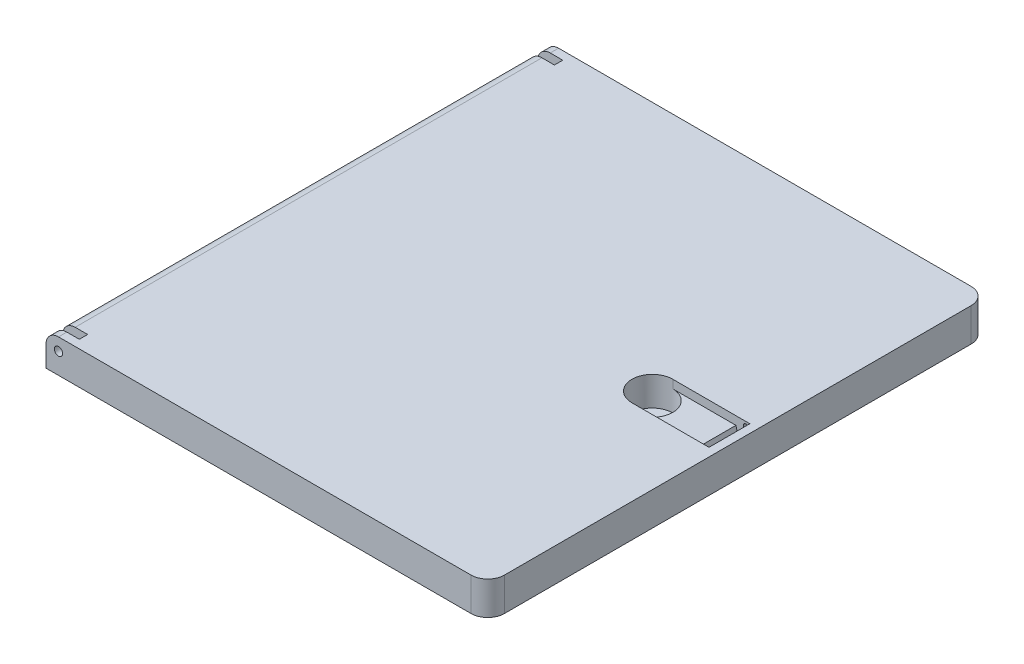
ISO-10303-21;
HEADER;
FILE_DESCRIPTION(('STEP AP214'),'2;1');
FILE_NAME('part.step','',(''),(''),'','','');
FILE_SCHEMA(('AUTOMOTIVE_DESIGN { 1 0 10303 214 1 1 1 1 }'));
ENDSEC;
DATA;
#1=APPLICATION_CONTEXT('core data for automotive mechanical design processes');
#2=APPLICATION_PROTOCOL_DEFINITION('international standard','automotive_design',2000,#1);
#3=PRODUCT_CONTEXT('',#1,'mechanical');
#4=PRODUCT('Part','Part','',(#3));
#5=PRODUCT_RELATED_PRODUCT_CATEGORY('part','',(#4));
#6=PRODUCT_DEFINITION_FORMATION('','',#4);
#7=PRODUCT_DEFINITION_CONTEXT('part definition',#1,'design');
#8=PRODUCT_DEFINITION('design','',#6,#7);
#9=PRODUCT_DEFINITION_SHAPE('','',#8);
#10=(LENGTH_UNIT() NAMED_UNIT(*) SI_UNIT(.MILLI.,.METRE.));
#11=(NAMED_UNIT(*) PLANE_ANGLE_UNIT() SI_UNIT($,.RADIAN.));
#12=(NAMED_UNIT(*) SI_UNIT($,.STERADIAN.) SOLID_ANGLE_UNIT());
#13=UNCERTAINTY_MEASURE_WITH_UNIT(LENGTH_MEASURE(1.E-05),#10,'distance_accuracy_value','');
#14=(GEOMETRIC_REPRESENTATION_CONTEXT(3) GLOBAL_UNCERTAINTY_ASSIGNED_CONTEXT((#13)) GLOBAL_UNIT_ASSIGNED_CONTEXT((#10,
#11,#12)) REPRESENTATION_CONTEXT('',''));
#15=CARTESIAN_POINT('',(0.,0.,0.));
#16=DIRECTION('',(0.,0.,1.));
#17=DIRECTION('',(1.,0.,0.));
#18=AXIS2_PLACEMENT_3D('',#15,#16,#17);
#19=CARTESIAN_POINT('',(-106.,-8.,0.));
#20=DIRECTION('',(-1.,0.,0.));
#21=DIRECTION('',(0.,0.,1.));
#22=AXIS2_PLACEMENT_3D('',#19,#20,#21);
#23=PLANE('',#22);
#24=DIRECTION('',(0.,1.,0.));
#25=VECTOR('',#24,1.);
#26=CARTESIAN_POINT('',(-106.,-8.,60.));
#27=LINE('',#26,#25);
#28=CARTESIAN_POINT('',(-106.,-8.,60.));
#29=VERTEX_POINT('',#28);
#30=CARTESIAN_POINT('',(-106.,-3.,60.));
#31=VERTEX_POINT('',#30);
#32=EDGE_CURVE('E266',#29,#31,#27,.T.);
#33=ORIENTED_EDGE('',*,*,#32,.T.);
#34=DIRECTION('',(0.,0.,1.));
#35=VECTOR('',#34,1.);
#36=CARTESIAN_POINT('',(-106.,-3.,-60.));
#37=LINE('',#36,#35);
#38=CARTESIAN_POINT('',(-106.,-3.,58.));
#39=VERTEX_POINT('',#38);
#40=EDGE_CURVE('E240',#39,#31,#37,.T.);
#41=ORIENTED_EDGE('',*,*,#40,.F.);
#42=DIRECTION('',(0.,1.,0.));
#43=VECTOR('',#42,1.);
#44=CARTESIAN_POINT('',(-106.,-6.,58.));
#45=LINE('',#44,#43);
#46=CARTESIAN_POINT('',(-106.,-6.,58.));
#47=VERTEX_POINT('',#46);
#48=EDGE_CURVE('E330',#47,#39,#45,.T.);
#49=ORIENTED_EDGE('',*,*,#48,.F.);
#50=DIRECTION('',(0.,0.,1.));
#51=VECTOR('',#50,1.);
#52=CARTESIAN_POINT('',(-106.,-6.,58.));
#53=LINE('',#52,#51);
#54=CARTESIAN_POINT('',(-106.,-6.,56.));
#55=VERTEX_POINT('',#54);
#56=EDGE_CURVE('E317',#55,#47,#53,.T.);
#57=ORIENTED_EDGE('',*,*,#56,.F.);
#58=DIRECTION('',(0.,1.,0.));
#59=VECTOR('',#58,1.);
#60=CARTESIAN_POINT('',(-106.,-6.,56.));
#61=LINE('',#60,#59);
#62=CARTESIAN_POINT('',(-106.,-3.,56.));
#63=VERTEX_POINT('',#62);
#64=EDGE_CURVE('E337',#55,#63,#61,.T.);
#65=ORIENTED_EDGE('',*,*,#64,.T.);
#66=CARTESIAN_POINT('',(-106.,-3.,-56.));
#67=VERTEX_POINT('',#66);
#68=EDGE_CURVE('E489',#67,#63,#37,.T.);
#69=ORIENTED_EDGE('',*,*,#68,.F.);
#70=DIRECTION('',(0.,1.,0.));
#71=VECTOR('',#70,1.);
#72=CARTESIAN_POINT('',(-106.,-6.,-56.));
#73=LINE('',#72,#71);
#74=CARTESIAN_POINT('',(-106.,-6.,-56.));
#75=VERTEX_POINT('',#74);
#76=EDGE_CURVE('E529',#75,#67,#73,.T.);
#77=ORIENTED_EDGE('',*,*,#76,.F.);
#78=DIRECTION('',(0.,0.,-1.));
#79=VECTOR('',#78,1.);
#80=CARTESIAN_POINT('',(-106.,-6.,-58.));
#81=LINE('',#80,#79);
#82=CARTESIAN_POINT('',(-106.,-6.,-58.));
#83=VERTEX_POINT('',#82);
#84=EDGE_CURVE('E521',#75,#83,#81,.T.);
#85=ORIENTED_EDGE('',*,*,#84,.T.);
#86=DIRECTION('',(0.,1.,0.));
#87=VECTOR('',#86,1.);
#88=CARTESIAN_POINT('',(-106.,-6.,-58.));
#89=LINE('',#88,#87);
#90=CARTESIAN_POINT('',(-106.,-3.,-58.));
#91=VERTEX_POINT('',#90);
#92=EDGE_CURVE('E301',#83,#91,#89,.T.);
#93=ORIENTED_EDGE('',*,*,#92,.T.);
#94=CARTESIAN_POINT('',(-106.,-3.,-60.));
#95=VERTEX_POINT('',#94);
#96=EDGE_CURVE('E55',#95,#91,#37,.T.);
#97=ORIENTED_EDGE('',*,*,#96,.F.);
#98=DIRECTION('',(0.,1.,0.));
#99=VECTOR('',#98,1.);
#100=CARTESIAN_POINT('',(-106.,-8.,-60.));
#101=LINE('',#100,#99);
#102=CARTESIAN_POINT('',(-106.,-8.,-60.));
#103=VERTEX_POINT('',#102);
#104=EDGE_CURVE('E251',#103,#95,#101,.T.);
#105=ORIENTED_EDGE('',*,*,#104,.F.);
#106=DIRECTION('',(0.,0.,1.));
#107=VECTOR('',#106,1.);
#108=CARTESIAN_POINT('',(-106.,-8.,0.));
#109=LINE('',#108,#107);
#110=EDGE_CURVE('E457',#103,#29,#109,.T.);
#111=ORIENTED_EDGE('',*,*,#110,.T.);
#112=EDGE_LOOP('',(#33,#41,#49,#57,#65,#69,#77,#85,#93,#97,#105,#111));
#113=FACE_BOUND('',#112,.T.);
#114=ADVANCED_FACE('F32',(#113),#23,.T.);
#115=CARTESIAN_POINT('',(0.,0.,0.));
#116=DIRECTION('',(0.,-1.,0.));
#117=DIRECTION('',(0.,0.,-1.));
#118=AXIS2_PLACEMENT_3D('',#115,#116,#117);
#119=PLANE('',#118);
#120=DIRECTION('',(0.,0.,-1.));
#121=VECTOR('',#120,1.);
#122=CARTESIAN_POINT('',(-2.,0.,0.));
#123=LINE('',#122,#121);
#124=CARTESIAN_POINT('',(-2.,0.,4.9));
#125=VERTEX_POINT('',#124);
#126=CARTESIAN_POINT('',(-2.,0.,-4.9));
#127=VERTEX_POINT('',#126);
#128=EDGE_CURVE('E427',#125,#127,#123,.T.);
#129=ORIENTED_EDGE('',*,*,#128,.F.);
#130=DIRECTION('',(1.,0.,0.));
#131=VECTOR('',#130,1.);
#132=CARTESIAN_POINT('',(-2.,0.,4.9));
#133=LINE('',#132,#131);
#134=CARTESIAN_POINT('',(-20.5,0.,4.9));
#135=VERTEX_POINT('',#134);
#136=EDGE_CURVE('E433',#135,#125,#133,.T.);
#137=ORIENTED_EDGE('',*,*,#136,.F.);
#138=CARTESIAN_POINT('',(-20.5,0.,0.));
#139=DIRECTION('',(0.,1.,0.));
#140=DIRECTION('',(0.,0.,1.));
#141=AXIS2_PLACEMENT_3D('',#138,#139,#140);
#142=CIRCLE('',#141,4.9);
#143=CARTESIAN_POINT('',(-20.5,0.,-4.9));
#144=VERTEX_POINT('',#143);
#145=EDGE_CURVE('E442',#144,#135,#142,.T.);
#146=ORIENTED_EDGE('',*,*,#145,.F.);
#147=DIRECTION('',(-1.,0.,0.));
#148=VECTOR('',#147,1.);
#149=CARTESIAN_POINT('',(-2.,0.,-4.9));
#150=LINE('',#149,#148);
#151=EDGE_CURVE('E439',#127,#144,#150,.T.);
#152=ORIENTED_EDGE('',*,*,#151,.F.);
#153=EDGE_LOOP('',(#129,#137,#146,#152));
#154=FACE_BOUND('',#153,.T.);
#155=DIRECTION('',(0.,0.,1.));
#156=VECTOR('',#155,1.);
#157=CARTESIAN_POINT('',(-103.,0.,-60.));
#158=LINE('',#157,#156);
#159=CARTESIAN_POINT('',(-103.,0.,58.));
#160=VERTEX_POINT('',#159);
#161=CARTESIAN_POINT('',(-103.,0.,60.));
#162=VERTEX_POINT('',#161);
#163=EDGE_CURVE('E47',#160,#162,#158,.T.);
#164=ORIENTED_EDGE('',*,*,#163,.T.);
#165=DIRECTION('',(1.,0.,0.));
#166=VECTOR('',#165,1.);
#167=CARTESIAN_POINT('',(0.,0.,60.));
#168=LINE('',#167,#166);
#169=CARTESIAN_POINT('',(-4.,0.,60.));
#170=VERTEX_POINT('',#169);
#171=EDGE_CURVE('E257',#162,#170,#168,.T.);
#172=ORIENTED_EDGE('',*,*,#171,.T.);
#173=CARTESIAN_POINT('',(-4.,0.,56.));
#174=DIRECTION('',(0.,-1.,0.));
#175=DIRECTION('',(0.,0.,-1.));
#176=AXIS2_PLACEMENT_3D('',#173,#174,#175);
#177=CIRCLE('',#176,4.);
#178=CARTESIAN_POINT('',(0.,0.,56.));
#179=VERTEX_POINT('',#178);
#180=EDGE_CURVE('E275',#170,#179,#177,.F.);
#181=ORIENTED_EDGE('',*,*,#180,.T.);
#182=DIRECTION('',(0.,0.,-1.));
#183=VECTOR('',#182,1.);
#184=CARTESIAN_POINT('',(0.,0.,0.));
#185=LINE('',#184,#183);
#186=CARTESIAN_POINT('',(0.,0.,-56.));
#187=VERTEX_POINT('',#186);
#188=EDGE_CURVE('E258',#179,#187,#185,.T.);
#189=ORIENTED_EDGE('',*,*,#188,.T.);
#190=CARTESIAN_POINT('',(-4.,0.,-56.));
#191=DIRECTION('',(0.,-1.,0.));
#192=DIRECTION('',(0.,0.,-1.));
#193=AXIS2_PLACEMENT_3D('',#190,#191,#192);
#194=CIRCLE('',#193,4.);
#195=CARTESIAN_POINT('',(-4.,0.,-60.));
#196=VERTEX_POINT('',#195);
#197=EDGE_CURVE('E256',#187,#196,#194,.F.);
#198=ORIENTED_EDGE('',*,*,#197,.T.);
#199=DIRECTION('',(-1.,0.,0.));
#200=VECTOR('',#199,1.);
#201=CARTESIAN_POINT('',(0.,0.,-60.));
#202=LINE('',#201,#200);
#203=CARTESIAN_POINT('',(-103.,0.,-60.));
#204=VERTEX_POINT('',#203);
#205=EDGE_CURVE('E248',#196,#204,#202,.T.);
#206=ORIENTED_EDGE('',*,*,#205,.T.);
#207=CARTESIAN_POINT('',(-103.,0.,-58.));
#208=VERTEX_POINT('',#207);
#209=EDGE_CURVE('E232',#204,#208,#158,.T.);
#210=ORIENTED_EDGE('',*,*,#209,.T.);
#211=DIRECTION('',(1.,0.,0.));
#212=VECTOR('',#211,1.);
#213=CARTESIAN_POINT('',(-106.,0.,-58.));
#214=LINE('',#213,#212);
#215=CARTESIAN_POINT('',(-100.,0.,-58.));
#216=VERTEX_POINT('',#215);
#217=EDGE_CURVE('E524',#208,#216,#214,.T.);
#218=ORIENTED_EDGE('',*,*,#217,.T.);
#219=DIRECTION('',(0.,0.,1.));
#220=VECTOR('',#219,1.);
#221=CARTESIAN_POINT('',(-100.,0.,-58.));
#222=LINE('',#221,#220);
#223=CARTESIAN_POINT('',(-100.,0.,-56.));
#224=VERTEX_POINT('',#223);
#225=EDGE_CURVE('E517',#216,#224,#222,.T.);
#226=ORIENTED_EDGE('',*,*,#225,.T.);
#227=DIRECTION('',(-1.,0.,0.));
#228=VECTOR('',#227,1.);
#229=CARTESIAN_POINT('',(-106.,0.,-56.));
#230=LINE('',#229,#228);
#231=CARTESIAN_POINT('',(-103.,0.,-56.));
#232=VERTEX_POINT('',#231);
#233=EDGE_CURVE('E514',#224,#232,#230,.T.);
#234=ORIENTED_EDGE('',*,*,#233,.T.);
#235=CARTESIAN_POINT('',(-103.,0.,56.));
#236=VERTEX_POINT('',#235);
#237=EDGE_CURVE('E241',#232,#236,#158,.T.);
#238=ORIENTED_EDGE('',*,*,#237,.T.);
#239=DIRECTION('',(-1.,0.,0.));
#240=VECTOR('',#239,1.);
#241=CARTESIAN_POINT('',(-106.,0.,56.));
#242=LINE('',#241,#240);
#243=CARTESIAN_POINT('',(-100.,0.,56.));
#244=VERTEX_POINT('',#243);
#245=EDGE_CURVE('E321',#244,#236,#242,.T.);
#246=ORIENTED_EDGE('',*,*,#245,.F.);
#247=DIRECTION('',(0.,0.,-1.));
#248=VECTOR('',#247,1.);
#249=CARTESIAN_POINT('',(-100.,0.,58.));
#250=LINE('',#249,#248);
#251=CARTESIAN_POINT('',(-100.,0.,58.));
#252=VERTEX_POINT('',#251);
#253=EDGE_CURVE('E332',#252,#244,#250,.T.);
#254=ORIENTED_EDGE('',*,*,#253,.F.);
#255=DIRECTION('',(1.,0.,0.));
#256=VECTOR('',#255,1.);
#257=CARTESIAN_POINT('',(-106.,0.,58.));
#258=LINE('',#257,#256);
#259=EDGE_CURVE('E316',#160,#252,#258,.T.);
#260=ORIENTED_EDGE('',*,*,#259,.F.);
#261=EDGE_LOOP('',(#164,#172,#181,#189,#198,#206,#210,#218,#226,#234,#238,#246,#254,#260));
#262=FACE_BOUND('',#261,.T.);
#263=ADVANCED_FACE('F254',(#154,#262),#119,.F.);
#264=CARTESIAN_POINT('',(-103.,-3.,-60.));
#265=DIRECTION('',(0.,0.,1.));
#266=DIRECTION('',(1.,0.,0.));
#267=AXIS2_PLACEMENT_3D('',#264,#265,#266);
#268=CYLINDRICAL_SURFACE('',#267,0.999999999999998);
#269=CARTESIAN_POINT('',(-103.,-3.,-60.));
#270=DIRECTION('',(0.,0.,1.));
#271=DIRECTION('',(1.,0.,0.));
#272=AXIS2_PLACEMENT_3D('',#269,#270,#271);
#273=CIRCLE('',#272,0.999999999999998);
#274=CARTESIAN_POINT('',(-102.,-3.,-60.));
#275=VERTEX_POINT('',#274);
#276=EDGE_CURVE('E297',#275,#275,#273,.T.);
#277=ORIENTED_EDGE('',*,*,#276,.F.);
#278=EDGE_LOOP('',(#277));
#279=FACE_BOUND('',#278,.T.);
#280=CARTESIAN_POINT('',(-103.,-3.,-58.));
#281=DIRECTION('',(0.,0.,1.));
#282=DIRECTION('',(1.,0.,0.));
#283=AXIS2_PLACEMENT_3D('',#280,#281,#282);
#284=CIRCLE('',#283,0.999999999999998);
#285=CARTESIAN_POINT('',(-102.,-3.,-58.));
#286=VERTEX_POINT('',#285);
#287=EDGE_CURVE('E300',#286,#286,#284,.F.);
#288=ORIENTED_EDGE('',*,*,#287,.F.);
#289=EDGE_LOOP('',(#288));
#290=FACE_BOUND('',#289,.T.);
#291=ADVANCED_FACE('F571',(#279,#290),#268,.F.);
#292=CARTESIAN_POINT('',(-103.,-3.,56.));
#293=DIRECTION('',(0.,0.,-1.));
#294=DIRECTION('',(-1.,0.,0.));
#295=AXIS2_PLACEMENT_3D('',#292,#293,#294);
#296=CIRCLE('',#295,0.999999999999998);
#297=CARTESIAN_POINT('',(-104.,-3.,56.));
#298=VERTEX_POINT('',#297);
#299=EDGE_CURVE('E296',#298,#298,#296,.T.);
#300=ORIENTED_EDGE('',*,*,#299,.F.);
#301=EDGE_LOOP('',(#300));
#302=FACE_BOUND('',#301,.T.);
#303=CARTESIAN_POINT('',(-103.,-3.,-56.));
#304=DIRECTION('',(0.,0.,-1.));
#305=DIRECTION('',(-1.,0.,0.));
#306=AXIS2_PLACEMENT_3D('',#303,#304,#305);
#307=CIRCLE('',#306,0.999999999999998);
#308=CARTESIAN_POINT('',(-104.,-3.,-56.));
#309=VERTEX_POINT('',#308);
#310=EDGE_CURVE('E298',#309,#309,#307,.F.);
#311=ORIENTED_EDGE('',*,*,#310,.F.);
#312=EDGE_LOOP('',(#311));
#313=FACE_BOUND('',#312,.T.);
#314=ADVANCED_FACE('F815',(#302,#313),#268,.F.);
#315=CARTESIAN_POINT('',(0.,-8.,60.));
#316=DIRECTION('',(0.,0.,1.));
#317=DIRECTION('',(1.,0.,0.));
#318=AXIS2_PLACEMENT_3D('',#315,#316,#317);
#319=PLANE('',#318);
#320=CARTESIAN_POINT('',(-103.,-3.,60.));
#321=DIRECTION('',(0.,0.,-1.));
#322=DIRECTION('',(1.,0.,0.));
#323=AXIS2_PLACEMENT_3D('',#320,#321,#322);
#324=CIRCLE('',#323,2.99999999999999);
#325=EDGE_CURVE('E252',#31,#162,#324,.T.);
#326=ORIENTED_EDGE('',*,*,#325,.F.);
#327=ORIENTED_EDGE('',*,*,#32,.F.);
#328=DIRECTION('',(1.,0.,0.));
#329=VECTOR('',#328,1.);
#330=CARTESIAN_POINT('',(0.,-8.,60.));
#331=LINE('',#330,#329);
#332=CARTESIAN_POINT('',(-4.,-8.,60.));
#333=VERTEX_POINT('',#332);
#334=EDGE_CURVE('E271',#29,#333,#331,.T.);
#335=ORIENTED_EDGE('',*,*,#334,.T.);
#336=DIRECTION('',(0.,1.,0.));
#337=VECTOR('',#336,1.);
#338=CARTESIAN_POINT('',(-4.,-8.,60.));
#339=LINE('',#338,#337);
#340=EDGE_CURVE('E269',#333,#170,#339,.T.);
#341=ORIENTED_EDGE('',*,*,#340,.T.);
#342=ORIENTED_EDGE('',*,*,#171,.F.);
#343=EDGE_LOOP('',(#326,#327,#335,#341,#342));
#344=FACE_BOUND('',#343,.T.);
#345=CARTESIAN_POINT('',(-103.,-3.,60.));
#346=DIRECTION('',(0.,0.,1.));
#347=DIRECTION('',(1.,0.,0.));
#348=AXIS2_PLACEMENT_3D('',#345,#346,#347);
#349=CIRCLE('',#348,0.999999999999998);
#350=CARTESIAN_POINT('',(-102.,-3.,60.));
#351=VERTEX_POINT('',#350);
#352=EDGE_CURVE('E303',#351,#351,#349,.T.);
#353=ORIENTED_EDGE('',*,*,#352,.F.);
#354=EDGE_LOOP('',(#353));
#355=FACE_BOUND('',#354,.T.);
#356=ADVANCED_FACE('F464',(#344,#355),#319,.T.);
#357=CARTESIAN_POINT('',(0.,-8.,-60.));
#358=DIRECTION('',(0.,0.,-1.));
#359=DIRECTION('',(-1.,0.,0.));
#360=AXIS2_PLACEMENT_3D('',#357,#358,#359);
#361=PLANE('',#360);
#362=CARTESIAN_POINT('',(-103.,-3.,-60.));
#363=DIRECTION('',(0.,0.,-1.));
#364=DIRECTION('',(1.,0.,0.));
#365=AXIS2_PLACEMENT_3D('',#362,#363,#364);
#366=CIRCLE('',#365,2.99999999999999);
#367=EDGE_CURVE('E235',#95,#204,#366,.T.);
#368=ORIENTED_EDGE('',*,*,#367,.T.);
#369=ORIENTED_EDGE('',*,*,#205,.F.);
#370=DIRECTION('',(0.,1.,0.));
#371=VECTOR('',#370,1.);
#372=CARTESIAN_POINT('',(-4.,-8.,-60.));
#373=LINE('',#372,#371);
#374=CARTESIAN_POINT('',(-4.,-8.,-60.));
#375=VERTEX_POINT('',#374);
#376=EDGE_CURVE('E286',#196,#375,#373,.F.);
#377=ORIENTED_EDGE('',*,*,#376,.T.);
#378=DIRECTION('',(-1.,0.,0.));
#379=VECTOR('',#378,1.);
#380=CARTESIAN_POINT('',(0.,-8.,-60.));
#381=LINE('',#380,#379);
#382=EDGE_CURVE('E455',#375,#103,#381,.T.);
#383=ORIENTED_EDGE('',*,*,#382,.T.);
#384=ORIENTED_EDGE('',*,*,#104,.T.);
#385=EDGE_LOOP('',(#368,#369,#377,#383,#384));
#386=FACE_BOUND('',#385,.T.);
#387=ORIENTED_EDGE('',*,*,#276,.T.);
#388=EDGE_LOOP('',(#387));
#389=FACE_BOUND('',#388,.T.);
#390=ADVANCED_FACE('F246',(#386,#389),#361,.T.);
#391=CARTESIAN_POINT('',(0.,-8.,0.));
#392=DIRECTION('',(1.,0.,0.));
#393=DIRECTION('',(0.,0.,-1.));
#394=AXIS2_PLACEMENT_3D('',#391,#392,#393);
#395=PLANE('',#394);
#396=ORIENTED_EDGE('',*,*,#188,.F.);
#397=DIRECTION('',(0.,1.,0.));
#398=VECTOR('',#397,1.);
#399=CARTESIAN_POINT('',(0.,-8.,56.));
#400=LINE('',#399,#398);
#401=CARTESIAN_POINT('',(0.,-8.,56.));
#402=VERTEX_POINT('',#401);
#403=EDGE_CURVE('E280',#179,#402,#400,.F.);
#404=ORIENTED_EDGE('',*,*,#403,.T.);
#405=DIRECTION('',(0.,0.,-1.));
#406=VECTOR('',#405,1.);
#407=CARTESIAN_POINT('',(0.,-8.,0.));
#408=LINE('',#407,#406);
#409=CARTESIAN_POINT('',(0.,-8.,-56.));
#410=VERTEX_POINT('',#409);
#411=EDGE_CURVE('E260',#402,#410,#408,.T.);
#412=ORIENTED_EDGE('',*,*,#411,.T.);
#413=DIRECTION('',(0.,1.,0.));
#414=VECTOR('',#413,1.);
#415=CARTESIAN_POINT('',(0.,-8.,-56.));
#416=LINE('',#415,#414);
#417=EDGE_CURVE('E277',#410,#187,#416,.T.);
#418=ORIENTED_EDGE('',*,*,#417,.T.);
#419=EDGE_LOOP('',(#396,#404,#412,#418));
#420=FACE_BOUND('',#419,.T.);
#421=ADVANCED_FACE('F476',(#420),#395,.T.);
#422=CARTESIAN_POINT('',(0.,-8.,0.));
#423=DIRECTION('',(0.,-1.,0.));
#424=DIRECTION('',(0.,0.,-1.));
#425=AXIS2_PLACEMENT_3D('',#422,#423,#424);
#426=PLANE('',#425);
#427=ORIENTED_EDGE('',*,*,#411,.F.);
#428=CARTESIAN_POINT('',(-4.,-8.,56.));
#429=DIRECTION('',(0.,-1.,0.));
#430=DIRECTION('',(0.,0.,-1.));
#431=AXIS2_PLACEMENT_3D('',#428,#429,#430);
#432=CIRCLE('',#431,4.);
#433=EDGE_CURVE('E284',#402,#333,#432,.T.);
#434=ORIENTED_EDGE('',*,*,#433,.T.);
#435=ORIENTED_EDGE('',*,*,#334,.F.);
#436=ORIENTED_EDGE('',*,*,#110,.F.);
#437=ORIENTED_EDGE('',*,*,#382,.F.);
#438=CARTESIAN_POINT('',(-4.,-8.,-56.));
#439=DIRECTION('',(0.,-1.,0.));
#440=DIRECTION('',(0.,0.,-1.));
#441=AXIS2_PLACEMENT_3D('',#438,#439,#440);
#442=CIRCLE('',#441,4.);
#443=EDGE_CURVE('E282',#375,#410,#442,.T.);
#444=ORIENTED_EDGE('',*,*,#443,.T.);
#445=EDGE_LOOP('',(#427,#434,#435,#436,#437,#444));
#446=FACE_BOUND('',#445,.T.);
#447=ADVANCED_FACE('F483',(#446),#426,.T.);
#448=CARTESIAN_POINT('',(-4.,-8.,56.));
#449=DIRECTION('',(0.,1.,0.));
#450=DIRECTION('',(0.,0.,1.));
#451=AXIS2_PLACEMENT_3D('',#448,#449,#450);
#452=CYLINDRICAL_SURFACE('',#451,4.);
#453=ORIENTED_EDGE('',*,*,#433,.F.);
#454=ORIENTED_EDGE('',*,*,#403,.F.);
#455=ORIENTED_EDGE('',*,*,#180,.F.);
#456=ORIENTED_EDGE('',*,*,#340,.F.);
#457=EDGE_LOOP('',(#453,#454,#455,#456));
#458=FACE_BOUND('',#457,.T.);
#459=ADVANCED_FACE('F472',(#458),#452,.T.);
#460=CARTESIAN_POINT('',(-4.,-8.,-56.));
#461=DIRECTION('',(0.,1.,0.));
#462=DIRECTION('',(0.,0.,1.));
#463=AXIS2_PLACEMENT_3D('',#460,#461,#462);
#464=CYLINDRICAL_SURFACE('',#463,4.);
#465=ORIENTED_EDGE('',*,*,#443,.F.);
#466=ORIENTED_EDGE('',*,*,#376,.F.);
#467=ORIENTED_EDGE('',*,*,#197,.F.);
#468=ORIENTED_EDGE('',*,*,#417,.F.);
#469=EDGE_LOOP('',(#465,#466,#467,#468));
#470=FACE_BOUND('',#469,.T.);
#471=ADVANCED_FACE('F481',(#470),#464,.T.);
#472=CARTESIAN_POINT('',(-2.,-2.,4.9));
#473=DIRECTION('',(0.,0.,1.));
#474=DIRECTION('',(1.,0.,0.));
#475=AXIS2_PLACEMENT_3D('',#472,#473,#474);
#476=PLANE('',#475);
#477=DIRECTION('',(0.,-1.,0.));
#478=VECTOR('',#477,1.);
#479=CARTESIAN_POINT('',(-2.5,-1.,4.9));
#480=LINE('',#479,#478);
#481=CARTESIAN_POINT('',(-2.5,-1.,4.9));
#482=VERTEX_POINT('',#481);
#483=CARTESIAN_POINT('',(-2.5,-6.,4.9));
#484=VERTEX_POINT('',#483);
#485=EDGE_CURVE('E363',#482,#484,#480,.T.);
#486=ORIENTED_EDGE('',*,*,#485,.F.);
#487=CARTESIAN_POINT('',(-3.,-1.,4.9));
#488=DIRECTION('',(0.,0.,-1.));
#489=DIRECTION('',(-1.,0.,0.));
#490=AXIS2_PLACEMENT_3D('',#487,#488,#489);
#491=CIRCLE('',#490,0.5);
#492=CARTESIAN_POINT('',(-3.5,-1.,4.9));
#493=VERTEX_POINT('',#492);
#494=EDGE_CURVE('E340',#493,#482,#491,.T.);
#495=ORIENTED_EDGE('',*,*,#494,.F.);
#496=DIRECTION('',(0.,1.,0.));
#497=VECTOR('',#496,1.);
#498=CARTESIAN_POINT('',(-3.5,-1.,4.9));
#499=LINE('',#498,#497);
#500=CARTESIAN_POINT('',(-3.5,-6.,4.9));
#501=VERTEX_POINT('',#500);
#502=EDGE_CURVE('E352',#501,#493,#499,.T.);
#503=ORIENTED_EDGE('',*,*,#502,.F.);
#504=CARTESIAN_POINT('',(-3.,-6.,4.9));
#505=DIRECTION('',(0.,0.,-1.));
#506=DIRECTION('',(-1.,0.,0.));
#507=AXIS2_PLACEMENT_3D('',#504,#505,#506);
#508=CIRCLE('',#507,0.5);
#509=EDGE_CURVE('E366',#484,#501,#508,.T.);
#510=ORIENTED_EDGE('',*,*,#509,.F.);
#511=EDGE_LOOP('',(#486,#495,#503,#510));
#512=FACE_BOUND('',#511,.T.);
#513=ORIENTED_EDGE('',*,*,#136,.T.);
#514=DIRECTION('',(0.,1.,0.));
#515=VECTOR('',#514,1.);
#516=CARTESIAN_POINT('',(-2.,-2.,4.9));
#517=LINE('',#516,#515);
#518=CARTESIAN_POINT('',(-2.,-7.,4.9));
#519=VERTEX_POINT('',#518);
#520=EDGE_CURVE('E262',#519,#125,#517,.T.);
#521=ORIENTED_EDGE('',*,*,#520,.F.);
#522=DIRECTION('',(1.,0.,0.));
#523=VECTOR('',#522,1.);
#524=CARTESIAN_POINT('',(-2.,-7.,4.9));
#525=LINE('',#524,#523);
#526=CARTESIAN_POINT('',(-4.,-7.,4.9));
#527=VERTEX_POINT('',#526);
#528=EDGE_CURVE('E420',#527,#519,#525,.T.);
#529=ORIENTED_EDGE('',*,*,#528,.F.);
#530=DIRECTION('',(-0.258819045102518,0.965925826289069,0.));
#531=VECTOR('',#530,1.);
#532=CARTESIAN_POINT('',(-5.11602540378444,-2.83493649053889,4.9));
#533=LINE('',#532,#531);
#534=CARTESIAN_POINT('',(-5.33974596215561,-2.,4.9));
#535=VERTEX_POINT('',#534);
#536=EDGE_CURVE('E290',#527,#535,#533,.T.);
#537=ORIENTED_EDGE('',*,*,#536,.T.);
#538=DIRECTION('',(1.,0.,0.));
#539=VECTOR('',#538,1.);
#540=CARTESIAN_POINT('',(-2.,-2.,4.9));
#541=LINE('',#540,#539);
#542=CARTESIAN_POINT('',(-20.5,-2.,4.9));
#543=VERTEX_POINT('',#542);
#544=EDGE_CURVE('E432',#543,#535,#541,.T.);
#545=ORIENTED_EDGE('',*,*,#544,.F.);
#546=DIRECTION('',(0.,1.,0.));
#547=VECTOR('',#546,1.);
#548=CARTESIAN_POINT('',(-20.5,-2.,4.9));
#549=LINE('',#548,#547);
#550=EDGE_CURVE('E448',#543,#135,#549,.T.);
#551=ORIENTED_EDGE('',*,*,#550,.T.);
#552=EDGE_LOOP('',(#513,#521,#529,#537,#545,#551));
#553=FACE_BOUND('',#552,.T.);
#554=ADVANCED_FACE('F582',(#512,#553),#476,.F.);
#555=CARTESIAN_POINT('',(-20.5,-2.,0.));
#556=DIRECTION('',(0.,1.,0.));
#557=DIRECTION('',(0.,0.,1.));
#558=AXIS2_PLACEMENT_3D('',#555,#556,#557);
#559=CYLINDRICAL_SURFACE('',#558,4.9);
#560=ORIENTED_EDGE('',*,*,#145,.T.);
#561=ORIENTED_EDGE('',*,*,#550,.F.);
#562=CARTESIAN_POINT('',(-20.5,-2.,0.));
#563=DIRECTION('',(0.,1.,0.));
#564=DIRECTION('',(0.,0.,1.));
#565=AXIS2_PLACEMENT_3D('',#562,#563,#564);
#566=CIRCLE('',#565,4.9);
#567=CARTESIAN_POINT('',(-20.5,-2.,-4.9));
#568=VERTEX_POINT('',#567);
#569=EDGE_CURVE('E423',#543,#568,#566,.T.);
#570=ORIENTED_EDGE('',*,*,#569,.T.);
#571=DIRECTION('',(0.,1.,0.));
#572=VECTOR('',#571,1.);
#573=CARTESIAN_POINT('',(-20.5,-2.,-4.9));
#574=LINE('',#573,#572);
#575=EDGE_CURVE('E450',#568,#144,#574,.T.);
#576=ORIENTED_EDGE('',*,*,#575,.T.);
#577=EDGE_LOOP('',(#560,#561,#570,#576));
#578=FACE_BOUND('',#577,.T.);
#579=CARTESIAN_POINT('',(-20.5,-7.,0.));
#580=DIRECTION('',(0.,1.,0.));
#581=DIRECTION('',(0.,0.,1.));
#582=AXIS2_PLACEMENT_3D('',#579,#580,#581);
#583=CIRCLE('',#582,4.9);
#584=CARTESIAN_POINT('',(-20.5,-7.,4.9));
#585=VERTEX_POINT('',#584);
#586=EDGE_CURVE('E424',#585,#585,#583,.T.);
#587=ORIENTED_EDGE('',*,*,#586,.F.);
#588=EDGE_LOOP('',(#587));
#589=FACE_BOUND('',#588,.T.);
#590=ADVANCED_FACE('F586',(#578,#589),#559,.F.);
#591=CARTESIAN_POINT('',(-2.,-2.,-4.9));
#592=DIRECTION('',(0.,0.,-1.));
#593=DIRECTION('',(-1.,0.,0.));
#594=AXIS2_PLACEMENT_3D('',#591,#592,#593);
#595=PLANE('',#594);
#596=DIRECTION('',(0.,-1.,0.));
#597=VECTOR('',#596,1.);
#598=CARTESIAN_POINT('',(-3.5,-1.,-4.9));
#599=LINE('',#598,#597);
#600=CARTESIAN_POINT('',(-3.5,-1.,-4.9));
#601=VERTEX_POINT('',#600);
#602=CARTESIAN_POINT('',(-3.5,-6.,-4.9));
#603=VERTEX_POINT('',#602);
#604=EDGE_CURVE('E395',#601,#603,#599,.T.);
#605=ORIENTED_EDGE('',*,*,#604,.F.);
#606=CARTESIAN_POINT('',(-3.,-1.,-4.9));
#607=DIRECTION('',(0.,0.,1.));
#608=DIRECTION('',(1.,0.,0.));
#609=AXIS2_PLACEMENT_3D('',#606,#607,#608);
#610=CIRCLE('',#609,0.5);
#611=CARTESIAN_POINT('',(-2.5,-1.,-4.9));
#612=VERTEX_POINT('',#611);
#613=EDGE_CURVE('E373',#612,#601,#610,.T.);
#614=ORIENTED_EDGE('',*,*,#613,.F.);
#615=DIRECTION('',(0.,1.,0.));
#616=VECTOR('',#615,1.);
#617=CARTESIAN_POINT('',(-2.5,-6.,-4.9));
#618=LINE('',#617,#616);
#619=CARTESIAN_POINT('',(-2.5,-6.,-4.9));
#620=VERTEX_POINT('',#619);
#621=EDGE_CURVE('E384',#620,#612,#618,.T.);
#622=ORIENTED_EDGE('',*,*,#621,.F.);
#623=CARTESIAN_POINT('',(-3.,-6.,-4.9));
#624=DIRECTION('',(0.,0.,1.));
#625=DIRECTION('',(1.,0.,0.));
#626=AXIS2_PLACEMENT_3D('',#623,#624,#625);
#627=CIRCLE('',#626,0.5);
#628=EDGE_CURVE('E398',#603,#620,#627,.T.);
#629=ORIENTED_EDGE('',*,*,#628,.F.);
#630=EDGE_LOOP('',(#605,#614,#622,#629));
#631=FACE_BOUND('',#630,.T.);
#632=ORIENTED_EDGE('',*,*,#151,.T.);
#633=ORIENTED_EDGE('',*,*,#575,.F.);
#634=DIRECTION('',(-1.,0.,0.));
#635=VECTOR('',#634,1.);
#636=CARTESIAN_POINT('',(-2.,-2.,-4.9));
#637=LINE('',#636,#635);
#638=CARTESIAN_POINT('',(-5.33974596215561,-2.,-4.9));
#639=VERTEX_POINT('',#638);
#640=EDGE_CURVE('E430',#639,#568,#637,.T.);
#641=ORIENTED_EDGE('',*,*,#640,.F.);
#642=DIRECTION('',(0.258819045102518,-0.965925826289069,0.));
#643=VECTOR('',#642,1.);
#644=CARTESIAN_POINT('',(-5.11602540378444,-2.83493649053889,-4.9));
#645=LINE('',#644,#643);
#646=CARTESIAN_POINT('',(-4.,-7.,-4.9));
#647=VERTEX_POINT('',#646);
#648=EDGE_CURVE('E40',#639,#647,#645,.T.);
#649=ORIENTED_EDGE('',*,*,#648,.T.);
#650=DIRECTION('',(-1.,0.,0.));
#651=VECTOR('',#650,1.);
#652=CARTESIAN_POINT('',(-2.,-7.,-4.9));
#653=LINE('',#652,#651);
#654=CARTESIAN_POINT('',(-2.,-7.,-4.9));
#655=VERTEX_POINT('',#654);
#656=EDGE_CURVE('E414',#655,#647,#653,.T.);
#657=ORIENTED_EDGE('',*,*,#656,.F.);
#658=DIRECTION('',(0.,1.,0.));
#659=VECTOR('',#658,1.);
#660=CARTESIAN_POINT('',(-2.,-2.,-4.9));
#661=LINE('',#660,#659);
#662=EDGE_CURVE('E436',#655,#127,#661,.T.);
#663=ORIENTED_EDGE('',*,*,#662,.T.);
#664=EDGE_LOOP('',(#632,#633,#641,#649,#657,#663));
#665=FACE_BOUND('',#664,.T.);
#666=ADVANCED_FACE('F592',(#631,#665),#595,.F.);
#667=CARTESIAN_POINT('',(-2.,-2.,0.));
#668=DIRECTION('',(1.,0.,0.));
#669=DIRECTION('',(0.,0.,-1.));
#670=AXIS2_PLACEMENT_3D('',#667,#668,#669);
#671=PLANE('',#670);
#672=ORIENTED_EDGE('',*,*,#128,.T.);
#673=ORIENTED_EDGE('',*,*,#662,.F.);
#674=DIRECTION('',(0.,0.,-1.));
#675=VECTOR('',#674,1.);
#676=CARTESIAN_POINT('',(-2.,-7.,-4.9));
#677=LINE('',#676,#675);
#678=EDGE_CURVE('E405',#519,#655,#677,.T.);
#679=ORIENTED_EDGE('',*,*,#678,.F.);
#680=ORIENTED_EDGE('',*,*,#520,.T.);
#681=EDGE_LOOP('',(#672,#673,#679,#680));
#682=FACE_BOUND('',#681,.T.);
#683=ADVANCED_FACE('F603',(#682),#671,.F.);
#684=CARTESIAN_POINT('',(-20.5,-2.,0.));
#685=DIRECTION('',(0.,1.,0.));
#686=DIRECTION('',(0.,0.,1.));
#687=AXIS2_PLACEMENT_3D('',#684,#685,#686);
#688=PLANE('',#687);
#689=ORIENTED_EDGE('',*,*,#544,.T.);
#690=DIRECTION('',(0.,0.,-1.));
#691=VECTOR('',#690,1.);
#692=CARTESIAN_POINT('',(-5.33974596215561,-2.,-4.9));
#693=LINE('',#692,#691);
#694=EDGE_CURVE('E288',#535,#639,#693,.T.);
#695=ORIENTED_EDGE('',*,*,#694,.T.);
#696=ORIENTED_EDGE('',*,*,#640,.T.);
#697=ORIENTED_EDGE('',*,*,#569,.F.);
#698=EDGE_LOOP('',(#689,#695,#696,#697));
#699=FACE_BOUND('',#698,.T.);
#700=ADVANCED_FACE('F598',(#699),#688,.T.);
#701=CARTESIAN_POINT('',(-20.5,-7.,0.));
#702=DIRECTION('',(0.,1.,0.));
#703=DIRECTION('',(0.,0.,1.));
#704=AXIS2_PLACEMENT_3D('',#701,#702,#703);
#705=PLANE('',#704);
#706=ORIENTED_EDGE('',*,*,#586,.T.);
#707=EDGE_LOOP('',(#706));
#708=FACE_BOUND('',#707,.T.);
#709=ADVANCED_FACE('F645',(#708),#705,.T.);
#710=CARTESIAN_POINT('',(0.,-7.,0.));
#711=DIRECTION('',(0.,-1.,0.));
#712=DIRECTION('',(0.,0.,-1.));
#713=AXIS2_PLACEMENT_3D('',#710,#711,#712);
#714=PLANE('',#713);
#715=ORIENTED_EDGE('',*,*,#678,.T.);
#716=ORIENTED_EDGE('',*,*,#656,.T.);
#717=DIRECTION('',(0.,0.,1.));
#718=VECTOR('',#717,1.);
#719=CARTESIAN_POINT('',(-4.,-7.,-4.9));
#720=LINE('',#719,#718);
#721=EDGE_CURVE('E417',#647,#527,#720,.T.);
#722=ORIENTED_EDGE('',*,*,#721,.T.);
#723=ORIENTED_EDGE('',*,*,#528,.T.);
#724=EDGE_LOOP('',(#715,#716,#722,#723));
#725=FACE_BOUND('',#724,.T.);
#726=ADVANCED_FACE('F649',(#725),#714,.F.);
#727=CARTESIAN_POINT('',(-3.,-1.,-6.9));
#728=DIRECTION('',(0.,0.,1.));
#729=DIRECTION('',(1.,0.,0.));
#730=AXIS2_PLACEMENT_3D('',#727,#728,#729);
#731=CYLINDRICAL_SURFACE('',#730,0.5);
#732=ORIENTED_EDGE('',*,*,#613,.T.);
#733=DIRECTION('',(0.,0.,1.));
#734=VECTOR('',#733,1.);
#735=CARTESIAN_POINT('',(-3.5,-1.,-6.9));
#736=LINE('',#735,#734);
#737=CARTESIAN_POINT('',(-3.5,-1.,-6.9));
#738=VERTEX_POINT('',#737);
#739=EDGE_CURVE('E393',#738,#601,#736,.T.);
#740=ORIENTED_EDGE('',*,*,#739,.F.);
#741=CARTESIAN_POINT('',(-3.,-1.,-6.9));
#742=DIRECTION('',(0.,0.,1.));
#743=DIRECTION('',(1.,0.,0.));
#744=AXIS2_PLACEMENT_3D('',#741,#742,#743);
#745=CIRCLE('',#744,0.5);
#746=CARTESIAN_POINT('',(-2.5,-1.,-6.9));
#747=VERTEX_POINT('',#746);
#748=EDGE_CURVE('E380',#747,#738,#745,.T.);
#749=ORIENTED_EDGE('',*,*,#748,.F.);
#750=DIRECTION('',(0.,0.,1.));
#751=VECTOR('',#750,1.);
#752=CARTESIAN_POINT('',(-2.5,-1.,-6.9));
#753=LINE('',#752,#751);
#754=EDGE_CURVE('E403',#747,#612,#753,.T.);
#755=ORIENTED_EDGE('',*,*,#754,.T.);
#756=EDGE_LOOP('',(#732,#740,#749,#755));
#757=FACE_BOUND('',#756,.T.);
#758=ADVANCED_FACE('F656',(#757),#731,.F.);
#759=CARTESIAN_POINT('',(-2.5,-6.,-6.9));
#760=DIRECTION('',(1.,0.,0.));
#761=DIRECTION('',(0.,0.,-1.));
#762=AXIS2_PLACEMENT_3D('',#759,#760,#761);
#763=PLANE('',#762);
#764=ORIENTED_EDGE('',*,*,#621,.T.);
#765=ORIENTED_EDGE('',*,*,#754,.F.);
#766=DIRECTION('',(0.,1.,0.));
#767=VECTOR('',#766,1.);
#768=CARTESIAN_POINT('',(-2.5,-6.,-6.9));
#769=LINE('',#768,#767);
#770=CARTESIAN_POINT('',(-2.5,-6.,-6.9));
#771=VERTEX_POINT('',#770);
#772=EDGE_CURVE('E390',#771,#747,#769,.T.);
#773=ORIENTED_EDGE('',*,*,#772,.F.);
#774=DIRECTION('',(0.,0.,1.));
#775=VECTOR('',#774,1.);
#776=CARTESIAN_POINT('',(-2.5,-6.,-6.9));
#777=LINE('',#776,#775);
#778=EDGE_CURVE('E406',#771,#620,#777,.T.);
#779=ORIENTED_EDGE('',*,*,#778,.T.);
#780=EDGE_LOOP('',(#764,#765,#773,#779));
#781=FACE_BOUND('',#780,.T.);
#782=ADVANCED_FACE('F661',(#781),#763,.F.);
#783=CARTESIAN_POINT('',(-3.,-6.,-6.9));
#784=DIRECTION('',(0.,0.,1.));
#785=DIRECTION('',(1.,0.,0.));
#786=AXIS2_PLACEMENT_3D('',#783,#784,#785);
#787=CYLINDRICAL_SURFACE('',#786,0.5);
#788=ORIENTED_EDGE('',*,*,#628,.T.);
#789=ORIENTED_EDGE('',*,*,#778,.F.);
#790=CARTESIAN_POINT('',(-3.,-6.,-6.9));
#791=DIRECTION('',(0.,0.,1.));
#792=DIRECTION('',(1.,0.,0.));
#793=AXIS2_PLACEMENT_3D('',#790,#791,#792);
#794=CIRCLE('',#793,0.5);
#795=CARTESIAN_POINT('',(-3.5,-6.,-6.9));
#796=VERTEX_POINT('',#795);
#797=EDGE_CURVE('E387',#796,#771,#794,.T.);
#798=ORIENTED_EDGE('',*,*,#797,.F.);
#799=DIRECTION('',(0.,0.,1.));
#800=VECTOR('',#799,1.);
#801=CARTESIAN_POINT('',(-3.5,-6.,-6.9));
#802=LINE('',#801,#800);
#803=EDGE_CURVE('E408',#796,#603,#802,.T.);
#804=ORIENTED_EDGE('',*,*,#803,.T.);
#805=EDGE_LOOP('',(#788,#789,#798,#804));
#806=FACE_BOUND('',#805,.T.);
#807=ADVANCED_FACE('F671',(#806),#787,.F.);
#808=CARTESIAN_POINT('',(-3.5,-1.,-6.9));
#809=DIRECTION('',(-1.,0.,0.));
#810=DIRECTION('',(0.,0.,1.));
#811=AXIS2_PLACEMENT_3D('',#808,#809,#810);
#812=PLANE('',#811);
#813=ORIENTED_EDGE('',*,*,#604,.T.);
#814=ORIENTED_EDGE('',*,*,#803,.F.);
#815=DIRECTION('',(0.,-1.,0.));
#816=VECTOR('',#815,1.);
#817=CARTESIAN_POINT('',(-3.5,-1.,-6.9));
#818=LINE('',#817,#816);
#819=EDGE_CURVE('E383',#738,#796,#818,.T.);
#820=ORIENTED_EDGE('',*,*,#819,.F.);
#821=ORIENTED_EDGE('',*,*,#739,.T.);
#822=EDGE_LOOP('',(#813,#814,#820,#821));
#823=FACE_BOUND('',#822,.T.);
#824=ADVANCED_FACE('F681',(#823),#812,.F.);
#825=CARTESIAN_POINT('',(-3.,-1.,-6.9));
#826=DIRECTION('',(0.,0.,1.));
#827=DIRECTION('',(1.,0.,0.));
#828=AXIS2_PLACEMENT_3D('',#825,#826,#827);
#829=PLANE('',#828);
#830=ORIENTED_EDGE('',*,*,#748,.T.);
#831=ORIENTED_EDGE('',*,*,#819,.T.);
#832=ORIENTED_EDGE('',*,*,#797,.T.);
#833=ORIENTED_EDGE('',*,*,#772,.T.);
#834=EDGE_LOOP('',(#830,#831,#832,#833));
#835=FACE_BOUND('',#834,.T.);
#836=ADVANCED_FACE('F691',(#835),#829,.T.);
#837=CARTESIAN_POINT('',(-3.,-1.,6.9));
#838=DIRECTION('',(0.,0.,-1.));
#839=DIRECTION('',(-1.,0.,0.));
#840=AXIS2_PLACEMENT_3D('',#837,#838,#839);
#841=CYLINDRICAL_SURFACE('',#840,0.5);
#842=ORIENTED_EDGE('',*,*,#494,.T.);
#843=DIRECTION('',(0.,0.,-1.));
#844=VECTOR('',#843,1.);
#845=CARTESIAN_POINT('',(-2.5,-1.,6.9));
#846=LINE('',#845,#844);
#847=CARTESIAN_POINT('',(-2.5,-1.,6.9));
#848=VERTEX_POINT('',#847);
#849=EDGE_CURVE('E361',#848,#482,#846,.T.);
#850=ORIENTED_EDGE('',*,*,#849,.F.);
#851=CARTESIAN_POINT('',(-3.,-1.,6.9));
#852=DIRECTION('',(0.,0.,-1.));
#853=DIRECTION('',(-1.,0.,0.));
#854=AXIS2_PLACEMENT_3D('',#851,#852,#853);
#855=CIRCLE('',#854,0.5);
#856=CARTESIAN_POINT('',(-3.5,-1.,6.9));
#857=VERTEX_POINT('',#856);
#858=EDGE_CURVE('E348',#857,#848,#855,.T.);
#859=ORIENTED_EDGE('',*,*,#858,.F.);
#860=DIRECTION('',(0.,0.,-1.));
#861=VECTOR('',#860,1.);
#862=CARTESIAN_POINT('',(-3.5,-1.,6.9));
#863=LINE('',#862,#861);
#864=EDGE_CURVE('E371',#857,#493,#863,.T.);
#865=ORIENTED_EDGE('',*,*,#864,.T.);
#866=EDGE_LOOP('',(#842,#850,#859,#865));
#867=FACE_BOUND('',#866,.T.);
#868=ADVANCED_FACE('F701',(#867),#841,.F.);
#869=CARTESIAN_POINT('',(-3.5,-1.,6.9));
#870=DIRECTION('',(-1.,0.,0.));
#871=DIRECTION('',(0.,0.,1.));
#872=AXIS2_PLACEMENT_3D('',#869,#870,#871);
#873=PLANE('',#872);
#874=ORIENTED_EDGE('',*,*,#502,.T.);
#875=ORIENTED_EDGE('',*,*,#864,.F.);
#876=DIRECTION('',(0.,1.,0.));
#877=VECTOR('',#876,1.);
#878=CARTESIAN_POINT('',(-3.5,-1.,6.9));
#879=LINE('',#878,#877);
#880=CARTESIAN_POINT('',(-3.5,-6.,6.9));
#881=VERTEX_POINT('',#880);
#882=EDGE_CURVE('E358',#881,#857,#879,.T.);
#883=ORIENTED_EDGE('',*,*,#882,.F.);
#884=DIRECTION('',(0.,0.,-1.));
#885=VECTOR('',#884,1.);
#886=CARTESIAN_POINT('',(-3.5,-6.,6.9));
#887=LINE('',#886,#885);
#888=EDGE_CURVE('E374',#881,#501,#887,.T.);
#889=ORIENTED_EDGE('',*,*,#888,.T.);
#890=EDGE_LOOP('',(#874,#875,#883,#889));
#891=FACE_BOUND('',#890,.T.);
#892=ADVANCED_FACE('F711',(#891),#873,.F.);
#893=CARTESIAN_POINT('',(-3.,-6.,6.9));
#894=DIRECTION('',(0.,0.,-1.));
#895=DIRECTION('',(-1.,0.,0.));
#896=AXIS2_PLACEMENT_3D('',#893,#894,#895);
#897=CYLINDRICAL_SURFACE('',#896,0.5);
#898=ORIENTED_EDGE('',*,*,#509,.T.);
#899=ORIENTED_EDGE('',*,*,#888,.F.);
#900=CARTESIAN_POINT('',(-3.,-6.,6.9));
#901=DIRECTION('',(0.,0.,-1.));
#902=DIRECTION('',(-1.,0.,0.));
#903=AXIS2_PLACEMENT_3D('',#900,#901,#902);
#904=CIRCLE('',#903,0.5);
#905=CARTESIAN_POINT('',(-2.5,-6.,6.9));
#906=VERTEX_POINT('',#905);
#907=EDGE_CURVE('E355',#906,#881,#904,.T.);
#908=ORIENTED_EDGE('',*,*,#907,.F.);
#909=DIRECTION('',(0.,0.,-1.));
#910=VECTOR('',#909,1.);
#911=CARTESIAN_POINT('',(-2.5,-6.,6.9));
#912=LINE('',#911,#910);
#913=EDGE_CURVE('E376',#906,#484,#912,.T.);
#914=ORIENTED_EDGE('',*,*,#913,.T.);
#915=EDGE_LOOP('',(#898,#899,#908,#914));
#916=FACE_BOUND('',#915,.T.);
#917=ADVANCED_FACE('F721',(#916),#897,.F.);
#918=CARTESIAN_POINT('',(-2.5,-1.,6.9));
#919=DIRECTION('',(1.,0.,0.));
#920=DIRECTION('',(0.,0.,-1.));
#921=AXIS2_PLACEMENT_3D('',#918,#919,#920);
#922=PLANE('',#921);
#923=ORIENTED_EDGE('',*,*,#485,.T.);
#924=ORIENTED_EDGE('',*,*,#913,.F.);
#925=DIRECTION('',(0.,-1.,0.));
#926=VECTOR('',#925,1.);
#927=CARTESIAN_POINT('',(-2.5,-1.,6.9));
#928=LINE('',#927,#926);
#929=EDGE_CURVE('E351',#848,#906,#928,.T.);
#930=ORIENTED_EDGE('',*,*,#929,.F.);
#931=ORIENTED_EDGE('',*,*,#849,.T.);
#932=EDGE_LOOP('',(#923,#924,#930,#931));
#933=FACE_BOUND('',#932,.T.);
#934=ADVANCED_FACE('F731',(#933),#922,.F.);
#935=CARTESIAN_POINT('',(-3.,-1.,6.9));
#936=DIRECTION('',(0.,0.,-1.));
#937=DIRECTION('',(-1.,0.,0.));
#938=AXIS2_PLACEMENT_3D('',#935,#936,#937);
#939=PLANE('',#938);
#940=ORIENTED_EDGE('',*,*,#858,.T.);
#941=ORIENTED_EDGE('',*,*,#929,.T.);
#942=ORIENTED_EDGE('',*,*,#907,.T.);
#943=ORIENTED_EDGE('',*,*,#882,.T.);
#944=EDGE_LOOP('',(#940,#941,#942,#943));
#945=FACE_BOUND('',#944,.T.);
#946=ADVANCED_FACE('F741',(#945),#939,.T.);
#947=CARTESIAN_POINT('',(-4.,-7.00000000000003,-4.9));
#948=DIRECTION('',(0.965925826289069,0.258819045102518,0.));
#949=DIRECTION('',(0.,0.,-1.));
#950=AXIS2_PLACEMENT_3D('',#947,#948,#949);
#951=PLANE('',#950);
#952=ORIENTED_EDGE('',*,*,#648,.F.);
#953=ORIENTED_EDGE('',*,*,#694,.F.);
#954=ORIENTED_EDGE('',*,*,#536,.F.);
#955=ORIENTED_EDGE('',*,*,#721,.F.);
#956=EDGE_LOOP('',(#952,#953,#954,#955));
#957=FACE_BOUND('',#956,.T.);
#958=ADVANCED_FACE('F34',(#957),#951,.T.);
#959=CARTESIAN_POINT('',(-106.,-6.,56.));
#960=DIRECTION('',(0.,0.,-1.));
#961=DIRECTION('',(-1.,0.,0.));
#962=AXIS2_PLACEMENT_3D('',#959,#960,#961);
#963=PLANE('',#962);
#964=ORIENTED_EDGE('',*,*,#299,.T.);
#965=EDGE_LOOP('',(#964));
#966=FACE_BOUND('',#965,.T.);
#967=ORIENTED_EDGE('',*,*,#245,.T.);
#968=CARTESIAN_POINT('',(-103.,-3.,56.));
#969=DIRECTION('',(0.,0.,-1.));
#970=DIRECTION('',(-1.,0.,0.));
#971=AXIS2_PLACEMENT_3D('',#968,#969,#970);
#972=CIRCLE('',#971,2.99999999999999);
#973=EDGE_CURVE('E510',#236,#63,#972,.F.);
#974=ORIENTED_EDGE('',*,*,#973,.T.);
#975=ORIENTED_EDGE('',*,*,#64,.F.);
#976=DIRECTION('',(-1.,0.,0.));
#977=VECTOR('',#976,1.);
#978=CARTESIAN_POINT('',(-106.,-6.,56.));
#979=LINE('',#978,#977);
#980=CARTESIAN_POINT('',(-100.,-6.,56.));
#981=VERTEX_POINT('',#980);
#982=EDGE_CURVE('E327',#981,#55,#979,.T.);
#983=ORIENTED_EDGE('',*,*,#982,.F.);
#984=DIRECTION('',(0.,1.,0.));
#985=VECTOR('',#984,1.);
#986=CARTESIAN_POINT('',(-100.,-6.,56.));
#987=LINE('',#986,#985);
#988=EDGE_CURVE('E341',#981,#244,#987,.T.);
#989=ORIENTED_EDGE('',*,*,#988,.T.);
#990=EDGE_LOOP('',(#967,#974,#975,#983,#989));
#991=FACE_BOUND('',#990,.T.);
#992=ADVANCED_FACE('F509',(#966,#991),#963,.F.);
#993=CARTESIAN_POINT('',(-100.,-6.,58.));
#994=DIRECTION('',(1.,0.,0.));
#995=DIRECTION('',(0.,0.,-1.));
#996=AXIS2_PLACEMENT_3D('',#993,#994,#995);
#997=PLANE('',#996);
#998=ORIENTED_EDGE('',*,*,#253,.T.);
#999=ORIENTED_EDGE('',*,*,#988,.F.);
#1000=DIRECTION('',(0.,0.,-1.));
#1001=VECTOR('',#1000,1.);
#1002=CARTESIAN_POINT('',(-100.,-6.,58.));
#1003=LINE('',#1002,#1001);
#1004=CARTESIAN_POINT('',(-100.,-6.,58.));
#1005=VERTEX_POINT('',#1004);
#1006=EDGE_CURVE('E324',#1005,#981,#1003,.T.);
#1007=ORIENTED_EDGE('',*,*,#1006,.F.);
#1008=DIRECTION('',(0.,1.,0.));
#1009=VECTOR('',#1008,1.);
#1010=CARTESIAN_POINT('',(-100.,-6.,58.));
#1011=LINE('',#1010,#1009);
#1012=EDGE_CURVE('E343',#1005,#252,#1011,.T.);
#1013=ORIENTED_EDGE('',*,*,#1012,.T.);
#1014=EDGE_LOOP('',(#998,#999,#1007,#1013));
#1015=FACE_BOUND('',#1014,.T.);
#1016=ADVANCED_FACE('F789',(#1015),#997,.F.);
#1017=CARTESIAN_POINT('',(-106.,-6.,58.));
#1018=DIRECTION('',(0.,0.,1.));
#1019=DIRECTION('',(1.,0.,0.));
#1020=AXIS2_PLACEMENT_3D('',#1017,#1018,#1019);
#1021=PLANE('',#1020);
#1022=CARTESIAN_POINT('',(-103.,-3.,58.));
#1023=DIRECTION('',(0.,0.,1.));
#1024=DIRECTION('',(1.,0.,0.));
#1025=AXIS2_PLACEMENT_3D('',#1022,#1023,#1024);
#1026=CIRCLE('',#1025,0.999999999999998);
#1027=CARTESIAN_POINT('',(-102.,-3.,58.));
#1028=VERTEX_POINT('',#1027);
#1029=EDGE_CURVE('E293',#1028,#1028,#1026,.T.);
#1030=ORIENTED_EDGE('',*,*,#1029,.T.);
#1031=EDGE_LOOP('',(#1030));
#1032=FACE_BOUND('',#1031,.T.);
#1033=ORIENTED_EDGE('',*,*,#48,.T.);
#1034=CARTESIAN_POINT('',(-103.,-3.,58.));
#1035=DIRECTION('',(0.,0.,1.));
#1036=DIRECTION('',(1.,0.,0.));
#1037=AXIS2_PLACEMENT_3D('',#1034,#1035,#1036);
#1038=CIRCLE('',#1037,2.99999999999999);
#1039=EDGE_CURVE('E491',#39,#160,#1038,.F.);
#1040=ORIENTED_EDGE('',*,*,#1039,.T.);
#1041=ORIENTED_EDGE('',*,*,#259,.T.);
#1042=ORIENTED_EDGE('',*,*,#1012,.F.);
#1043=DIRECTION('',(1.,0.,0.));
#1044=VECTOR('',#1043,1.);
#1045=CARTESIAN_POINT('',(-106.,-6.,58.));
#1046=LINE('',#1045,#1044);
#1047=EDGE_CURVE('E320',#47,#1005,#1046,.T.);
#1048=ORIENTED_EDGE('',*,*,#1047,.F.);
#1049=EDGE_LOOP('',(#1033,#1040,#1041,#1042,#1048));
#1050=FACE_BOUND('',#1049,.T.);
#1051=ADVANCED_FACE('F498',(#1032,#1050),#1021,.F.);
#1052=CARTESIAN_POINT('',(0.,-6.,0.));
#1053=DIRECTION('',(0.,-1.,0.));
#1054=DIRECTION('',(0.,0.,-1.));
#1055=AXIS2_PLACEMENT_3D('',#1052,#1053,#1054);
#1056=PLANE('',#1055);
#1057=ORIENTED_EDGE('',*,*,#56,.T.);
#1058=ORIENTED_EDGE('',*,*,#1047,.T.);
#1059=ORIENTED_EDGE('',*,*,#1006,.T.);
#1060=ORIENTED_EDGE('',*,*,#982,.T.);
#1061=EDGE_LOOP('',(#1057,#1058,#1059,#1060));
#1062=FACE_BOUND('',#1061,.T.);
#1063=ADVANCED_FACE('F502',(#1062),#1056,.F.);
#1064=ORIENTED_EDGE('',*,*,#352,.T.);
#1065=EDGE_LOOP('',(#1064));
#1066=FACE_BOUND('',#1065,.T.);
#1067=ORIENTED_EDGE('',*,*,#1029,.F.);
#1068=EDGE_LOOP('',(#1067));
#1069=FACE_BOUND('',#1068,.T.);
#1070=ADVANCED_FACE('F805',(#1066,#1069),#268,.F.);
#1071=CARTESIAN_POINT('',(-106.,-6.,-58.));
#1072=DIRECTION('',(0.,0.,1.));
#1073=DIRECTION('',(1.,0.,0.));
#1074=AXIS2_PLACEMENT_3D('',#1071,#1072,#1073);
#1075=PLANE('',#1074);
#1076=CARTESIAN_POINT('',(-103.,-3.,-58.));
#1077=DIRECTION('',(0.,0.,1.));
#1078=DIRECTION('',(1.,0.,0.));
#1079=AXIS2_PLACEMENT_3D('',#1076,#1077,#1078);
#1080=CIRCLE('',#1079,2.99999999999999);
#1081=EDGE_CURVE('E236',#91,#208,#1080,.F.);
#1082=ORIENTED_EDGE('',*,*,#1081,.F.);
#1083=ORIENTED_EDGE('',*,*,#92,.F.);
#1084=DIRECTION('',(1.,0.,0.));
#1085=VECTOR('',#1084,1.);
#1086=CARTESIAN_POINT('',(-106.,-6.,-58.));
#1087=LINE('',#1086,#1085);
#1088=CARTESIAN_POINT('',(-100.,-6.,-58.));
#1089=VERTEX_POINT('',#1088);
#1090=EDGE_CURVE('E528',#83,#1089,#1087,.T.);
#1091=ORIENTED_EDGE('',*,*,#1090,.T.);
#1092=DIRECTION('',(0.,1.,0.));
#1093=VECTOR('',#1092,1.);
#1094=CARTESIAN_POINT('',(-100.,-6.,-58.));
#1095=LINE('',#1094,#1093);
#1096=EDGE_CURVE('E535',#1089,#216,#1095,.T.);
#1097=ORIENTED_EDGE('',*,*,#1096,.T.);
#1098=ORIENTED_EDGE('',*,*,#217,.F.);
#1099=EDGE_LOOP('',(#1082,#1083,#1091,#1097,#1098));
#1100=FACE_BOUND('',#1099,.T.);
#1101=ORIENTED_EDGE('',*,*,#287,.T.);
#1102=EDGE_LOOP('',(#1101));
#1103=FACE_BOUND('',#1102,.T.);
#1104=ADVANCED_FACE('F552',(#1100,#1103),#1075,.T.);
#1105=CARTESIAN_POINT('',(-106.,-6.,-56.));
#1106=DIRECTION('',(0.,0.,-1.));
#1107=DIRECTION('',(-1.,0.,0.));
#1108=AXIS2_PLACEMENT_3D('',#1105,#1106,#1107);
#1109=PLANE('',#1108);
#1110=CARTESIAN_POINT('',(-103.,-3.,-56.));
#1111=DIRECTION('',(0.,0.,-1.));
#1112=DIRECTION('',(-1.,0.,0.));
#1113=AXIS2_PLACEMENT_3D('',#1110,#1111,#1112);
#1114=CIRCLE('',#1113,2.99999999999999);
#1115=EDGE_CURVE('E11',#232,#67,#1114,.F.);
#1116=ORIENTED_EDGE('',*,*,#1115,.F.);
#1117=ORIENTED_EDGE('',*,*,#233,.F.);
#1118=DIRECTION('',(0.,1.,0.));
#1119=VECTOR('',#1118,1.);
#1120=CARTESIAN_POINT('',(-100.,-6.,-56.));
#1121=LINE('',#1120,#1119);
#1122=CARTESIAN_POINT('',(-100.,-6.,-56.));
#1123=VERTEX_POINT('',#1122);
#1124=EDGE_CURVE('E538',#1123,#224,#1121,.T.);
#1125=ORIENTED_EDGE('',*,*,#1124,.F.);
#1126=DIRECTION('',(-1.,0.,0.));
#1127=VECTOR('',#1126,1.);
#1128=CARTESIAN_POINT('',(-106.,-6.,-56.));
#1129=LINE('',#1128,#1127);
#1130=EDGE_CURVE('E523',#1123,#75,#1129,.T.);
#1131=ORIENTED_EDGE('',*,*,#1130,.T.);
#1132=ORIENTED_EDGE('',*,*,#76,.T.);
#1133=EDGE_LOOP('',(#1116,#1117,#1125,#1131,#1132));
#1134=FACE_BOUND('',#1133,.T.);
#1135=ORIENTED_EDGE('',*,*,#310,.T.);
#1136=EDGE_LOOP('',(#1135));
#1137=FACE_BOUND('',#1136,.T.);
#1138=ADVANCED_FACE('F541',(#1134,#1137),#1109,.T.);
#1139=CARTESIAN_POINT('',(-100.,-6.,-58.));
#1140=DIRECTION('',(-1.,0.,0.));
#1141=DIRECTION('',(0.,0.,1.));
#1142=AXIS2_PLACEMENT_3D('',#1139,#1140,#1141);
#1143=PLANE('',#1142);
#1144=ORIENTED_EDGE('',*,*,#225,.F.);
#1145=ORIENTED_EDGE('',*,*,#1096,.F.);
#1146=DIRECTION('',(0.,0.,1.));
#1147=VECTOR('',#1146,1.);
#1148=CARTESIAN_POINT('',(-100.,-6.,-58.));
#1149=LINE('',#1148,#1147);
#1150=EDGE_CURVE('E526',#1089,#1123,#1149,.T.);
#1151=ORIENTED_EDGE('',*,*,#1150,.T.);
#1152=ORIENTED_EDGE('',*,*,#1124,.T.);
#1153=EDGE_LOOP('',(#1144,#1145,#1151,#1152));
#1154=FACE_BOUND('',#1153,.T.);
#1155=ADVANCED_FACE('F555',(#1154),#1143,.T.);
#1156=CARTESIAN_POINT('',(0.,-6.,0.));
#1157=DIRECTION('',(0.,-1.,0.));
#1158=DIRECTION('',(0.,0.,1.));
#1159=AXIS2_PLACEMENT_3D('',#1156,#1157,#1158);
#1160=PLANE('',#1159);
#1161=ORIENTED_EDGE('',*,*,#84,.F.);
#1162=ORIENTED_EDGE('',*,*,#1130,.F.);
#1163=ORIENTED_EDGE('',*,*,#1150,.F.);
#1164=ORIENTED_EDGE('',*,*,#1090,.F.);
#1165=EDGE_LOOP('',(#1161,#1162,#1163,#1164));
#1166=FACE_BOUND('',#1165,.T.);
#1167=ADVANCED_FACE('F548',(#1166),#1160,.F.);
#1168=CARTESIAN_POINT('',(-103.,-3.,-60.));
#1169=DIRECTION('',(0.,0.,1.));
#1170=DIRECTION('',(1.,0.,0.));
#1171=AXIS2_PLACEMENT_3D('',#1168,#1169,#1170);
#1172=CYLINDRICAL_SURFACE('',#1171,2.99999999999999);
#1173=ORIENTED_EDGE('',*,*,#237,.F.);
#1174=ORIENTED_EDGE('',*,*,#1115,.T.);
#1175=ORIENTED_EDGE('',*,*,#68,.T.);
#1176=ORIENTED_EDGE('',*,*,#973,.F.);
#1177=EDGE_LOOP('',(#1173,#1174,#1175,#1176));
#1178=FACE_BOUND('',#1177,.T.);
#1179=ADVANCED_FACE('F562',(#1178),#1172,.T.);
#1180=ORIENTED_EDGE('',*,*,#1081,.T.);
#1181=ORIENTED_EDGE('',*,*,#209,.F.);
#1182=ORIENTED_EDGE('',*,*,#367,.F.);
#1183=ORIENTED_EDGE('',*,*,#96,.T.);
#1184=EDGE_LOOP('',(#1180,#1181,#1182,#1183));
#1185=FACE_BOUND('',#1184,.T.);
#1186=ADVANCED_FACE('F234',(#1185),#1172,.T.);
#1187=ORIENTED_EDGE('',*,*,#40,.T.);
#1188=ORIENTED_EDGE('',*,*,#325,.T.);
#1189=ORIENTED_EDGE('',*,*,#163,.F.);
#1190=ORIENTED_EDGE('',*,*,#1039,.F.);
#1191=EDGE_LOOP('',(#1187,#1188,#1189,#1190));
#1192=FACE_BOUND('',#1191,.T.);
#1193=ADVANCED_FACE('F494',(#1192),#1172,.T.);
#1194=CLOSED_SHELL('',(#114,#263,#291,#314,#356,#390,#421,#447,#459,#471,#554,#590,#666,#683,
#700,#709,#726,#758,#782,#807,#824,#836,#868,#892,#917,#934,#946,#958,#992,#1016,#1051,#1063,
#1070,#1104,#1138,#1155,#1167,#1179,#1186,#1193));
#1195=MANIFOLD_SOLID_BREP('B2',#1194);
#1196=ADVANCED_BREP_SHAPE_REPRESENTATION('',(#18,#1195),#14);
#1197=SHAPE_DEFINITION_REPRESENTATION(#9,#1196);
ENDSEC;
END-ISO-10303-21;
